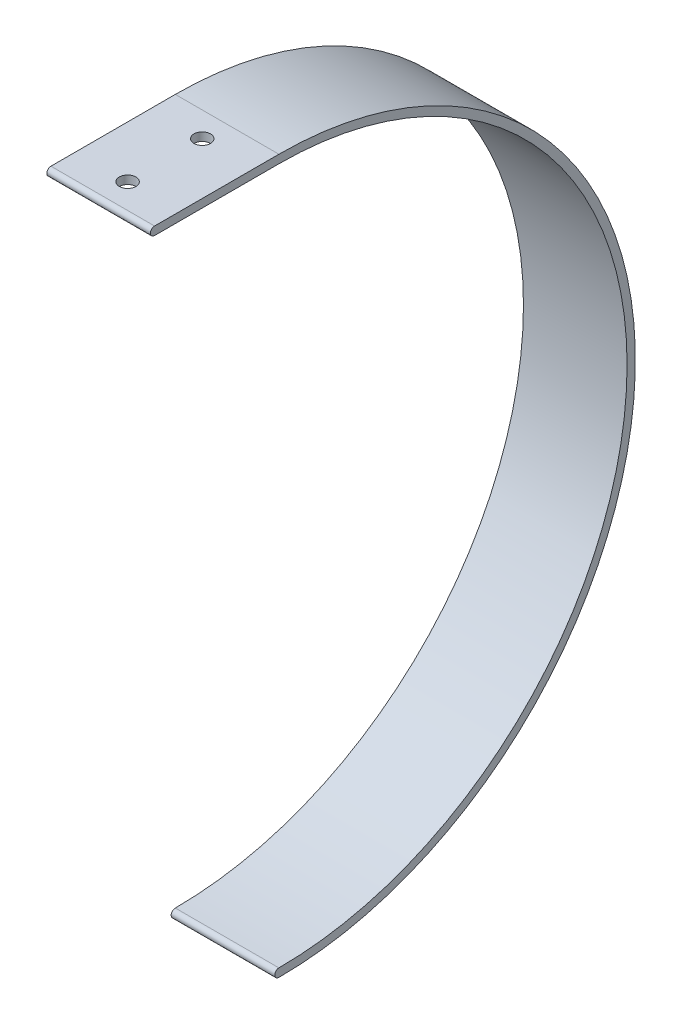
ISO-10303-21;
HEADER;
FILE_DESCRIPTION(('STEP AP214'),'2;1');
FILE_NAME('part.step','',(''),(''),'','','');
FILE_SCHEMA(('AUTOMOTIVE_DESIGN { 1 0 10303 214 1 1 1 1 }'));
ENDSEC;
DATA;
#1=APPLICATION_CONTEXT('core data for automotive mechanical design processes');
#2=APPLICATION_PROTOCOL_DEFINITION('international standard','automotive_design',2000,#1);
#3=PRODUCT_CONTEXT('',#1,'mechanical');
#4=PRODUCT('Part','Part','',(#3));
#5=PRODUCT_RELATED_PRODUCT_CATEGORY('part','',(#4));
#6=PRODUCT_DEFINITION_FORMATION('','',#4);
#7=PRODUCT_DEFINITION_CONTEXT('part definition',#1,'design');
#8=PRODUCT_DEFINITION('design','',#6,#7);
#9=PRODUCT_DEFINITION_SHAPE('','',#8);
#10=(LENGTH_UNIT() NAMED_UNIT(*) SI_UNIT(.MILLI.,.METRE.));
#11=(NAMED_UNIT(*) PLANE_ANGLE_UNIT() SI_UNIT($,.RADIAN.));
#12=(NAMED_UNIT(*) SI_UNIT($,.STERADIAN.) SOLID_ANGLE_UNIT());
#13=UNCERTAINTY_MEASURE_WITH_UNIT(LENGTH_MEASURE(1.E-05),#10,'distance_accuracy_value','');
#14=(GEOMETRIC_REPRESENTATION_CONTEXT(3) GLOBAL_UNCERTAINTY_ASSIGNED_CONTEXT((#13)) GLOBAL_UNIT_ASSIGNED_CONTEXT((#10,
#11,#12)) REPRESENTATION_CONTEXT('',''));
#15=CARTESIAN_POINT('',(0.,0.,0.));
#16=DIRECTION('',(0.,0.,1.));
#17=DIRECTION('',(1.,0.,0.));
#18=AXIS2_PLACEMENT_3D('',#15,#16,#17);
#19=CARTESIAN_POINT('',(25.,0.,-10.));
#20=DIRECTION('',(-1.,0.,0.));
#21=DIRECTION('',(0.,0.,1.));
#22=AXIS2_PLACEMENT_3D('',#19,#20,#21);
#23=CYLINDRICAL_SURFACE('',#22,84.);
#24=CARTESIAN_POINT('',(0.,0.,-10.));
#25=DIRECTION('',(-1.,0.,0.));
#26=DIRECTION('',(0.,0.,1.));
#27=AXIS2_PLACEMENT_3D('',#24,#25,#26);
#28=CIRCLE('',#27,84.);
#29=CARTESIAN_POINT('',(0.,84.,-10.));
#30=VERTEX_POINT('',#29);
#31=CARTESIAN_POINT('',(0.,-84.,-9.99999999999999));
#32=VERTEX_POINT('',#31);
#33=EDGE_CURVE('E119',#30,#32,#28,.T.);
#34=ORIENTED_EDGE('',*,*,#33,.T.);
#35=DIRECTION('',(-1.,0.,0.));
#36=VECTOR('',#35,1.);
#37=CARTESIAN_POINT('',(25.,-84.,-9.99999999999999));
#38=LINE('',#37,#36);
#39=CARTESIAN_POINT('',(25.,-84.,-9.99999999999999));
#40=VERTEX_POINT('',#39);
#41=EDGE_CURVE('E11',#40,#32,#38,.T.);
#42=ORIENTED_EDGE('',*,*,#41,.F.);
#43=CARTESIAN_POINT('',(25.,0.,-10.));
#44=DIRECTION('',(-1.,0.,0.));
#45=DIRECTION('',(0.,0.,1.));
#46=AXIS2_PLACEMENT_3D('',#43,#44,#45);
#47=CIRCLE('',#46,84.);
#48=CARTESIAN_POINT('',(25.,84.,-10.));
#49=VERTEX_POINT('',#48);
#50=EDGE_CURVE('E130',#49,#40,#47,.T.);
#51=ORIENTED_EDGE('',*,*,#50,.F.);
#52=DIRECTION('',(-1.,0.,0.));
#53=VECTOR('',#52,1.);
#54=CARTESIAN_POINT('',(25.,84.,-10.));
#55=LINE('',#54,#53);
#56=EDGE_CURVE('E115',#49,#30,#55,.T.);
#57=ORIENTED_EDGE('',*,*,#56,.T.);
#58=EDGE_LOOP('',(#34,#42,#51,#57));
#59=FACE_BOUND('',#58,.T.);
#60=ADVANCED_FACE('F33',(#59),#23,.F.);
#61=CARTESIAN_POINT('',(25.,-85.,-10.));
#62=DIRECTION('',(-1.,0.,0.));
#63=DIRECTION('',(0.,0.,1.));
#64=AXIS2_PLACEMENT_3D('',#61,#62,#63);
#65=CYLINDRICAL_SURFACE('',#64,1.);
#66=CARTESIAN_POINT('',(0.,-85.,-10.));
#67=DIRECTION('',(1.,0.,0.));
#68=DIRECTION('',(0.,0.,-1.));
#69=AXIS2_PLACEMENT_3D('',#66,#67,#68);
#70=CIRCLE('',#69,1.);
#71=CARTESIAN_POINT('',(0.,-86.,-10.));
#72=VERTEX_POINT('',#71);
#73=EDGE_CURVE('E122',#32,#72,#70,.T.);
#74=ORIENTED_EDGE('',*,*,#73,.T.);
#75=DIRECTION('',(-1.,0.,0.));
#76=VECTOR('',#75,1.);
#77=CARTESIAN_POINT('',(25.,-86.,-10.));
#78=LINE('',#77,#76);
#79=CARTESIAN_POINT('',(25.,-86.,-10.));
#80=VERTEX_POINT('',#79);
#81=EDGE_CURVE('E42',#80,#72,#78,.T.);
#82=ORIENTED_EDGE('',*,*,#81,.F.);
#83=CARTESIAN_POINT('',(25.,-85.,-10.));
#84=DIRECTION('',(1.,0.,0.));
#85=DIRECTION('',(0.,0.,-1.));
#86=AXIS2_PLACEMENT_3D('',#83,#84,#85);
#87=CIRCLE('',#86,1.);
#88=EDGE_CURVE('E88',#40,#80,#87,.T.);
#89=ORIENTED_EDGE('',*,*,#88,.F.);
#90=ORIENTED_EDGE('',*,*,#41,.T.);
#91=EDGE_LOOP('',(#74,#82,#89,#90));
#92=FACE_BOUND('',#91,.T.);
#93=ADVANCED_FACE('F150',(#92),#65,.T.);
#94=CARTESIAN_POINT('',(25.,0.,-10.));
#95=DIRECTION('',(-1.,0.,0.));
#96=DIRECTION('',(0.,0.,1.));
#97=AXIS2_PLACEMENT_3D('',#94,#95,#96);
#98=CYLINDRICAL_SURFACE('',#97,86.);
#99=CARTESIAN_POINT('',(0.,0.,-10.));
#100=DIRECTION('',(1.,0.,0.));
#101=DIRECTION('',(0.,0.,1.));
#102=AXIS2_PLACEMENT_3D('',#99,#100,#101);
#103=CIRCLE('',#102,86.);
#104=CARTESIAN_POINT('',(0.,86.,-10.));
#105=VERTEX_POINT('',#104);
#106=EDGE_CURVE('E125',#72,#105,#103,.T.);
#107=ORIENTED_EDGE('',*,*,#106,.T.);
#108=DIRECTION('',(-1.,0.,0.));
#109=VECTOR('',#108,1.);
#110=CARTESIAN_POINT('',(25.,86.,-10.));
#111=LINE('',#110,#109);
#112=CARTESIAN_POINT('',(25.,86.,-10.));
#113=VERTEX_POINT('',#112);
#114=EDGE_CURVE('E110',#113,#105,#111,.T.);
#115=ORIENTED_EDGE('',*,*,#114,.F.);
#116=CARTESIAN_POINT('',(25.,0.,-10.));
#117=DIRECTION('',(1.,0.,0.));
#118=DIRECTION('',(0.,0.,1.));
#119=AXIS2_PLACEMENT_3D('',#116,#117,#118);
#120=CIRCLE('',#119,86.);
#121=EDGE_CURVE('E101',#80,#113,#120,.T.);
#122=ORIENTED_EDGE('',*,*,#121,.F.);
#123=ORIENTED_EDGE('',*,*,#81,.T.);
#124=EDGE_LOOP('',(#107,#115,#122,#123));
#125=FACE_BOUND('',#124,.T.);
#126=ADVANCED_FACE('F153',(#125),#98,.T.);
#127=CARTESIAN_POINT('',(25.,86.,-10.));
#128=DIRECTION('',(0.,-1.,0.));
#129=DIRECTION('',(0.,0.,-1.));
#130=AXIS2_PLACEMENT_3D('',#127,#128,#129);
#131=PLANE('',#130);
#132=CARTESIAN_POINT('',(12.5,86.,14.));
#133=DIRECTION('',(0.,1.,0.));
#134=DIRECTION('',(0.,0.,1.));
#135=AXIS2_PLACEMENT_3D('',#132,#133,#134);
#136=CIRCLE('',#135,2.);
#137=CARTESIAN_POINT('',(12.5,86.,16.));
#138=VERTEX_POINT('',#137);
#139=EDGE_CURVE('E144',#138,#138,#136,.T.);
#140=ORIENTED_EDGE('',*,*,#139,.F.);
#141=EDGE_LOOP('',(#140));
#142=FACE_BOUND('',#141,.T.);
#143=CARTESIAN_POINT('',(12.5,86.,-4.));
#144=DIRECTION('',(0.,1.,0.));
#145=DIRECTION('',(0.,0.,1.));
#146=AXIS2_PLACEMENT_3D('',#143,#144,#145);
#147=CIRCLE('',#146,2.);
#148=CARTESIAN_POINT('',(12.5,86.,-2.));
#149=VERTEX_POINT('',#148);
#150=EDGE_CURVE('E136',#149,#149,#147,.T.);
#151=ORIENTED_EDGE('',*,*,#150,.F.);
#152=EDGE_LOOP('',(#151));
#153=FACE_BOUND('',#152,.T.);
#154=DIRECTION('',(0.,0.,1.));
#155=VECTOR('',#154,1.);
#156=CARTESIAN_POINT('',(0.,86.,-10.));
#157=LINE('',#156,#155);
#158=CARTESIAN_POINT('',(0.,86.,20.));
#159=VERTEX_POINT('',#158);
#160=EDGE_CURVE('E109',#105,#159,#157,.T.);
#161=ORIENTED_EDGE('',*,*,#160,.T.);
#162=DIRECTION('',(-1.,0.,0.));
#163=VECTOR('',#162,1.);
#164=CARTESIAN_POINT('',(25.,86.,20.));
#165=LINE('',#164,#163);
#166=CARTESIAN_POINT('',(25.,86.,20.));
#167=VERTEX_POINT('',#166);
#168=EDGE_CURVE('E106',#167,#159,#165,.T.);
#169=ORIENTED_EDGE('',*,*,#168,.F.);
#170=DIRECTION('',(0.,0.,1.));
#171=VECTOR('',#170,1.);
#172=CARTESIAN_POINT('',(25.,86.,-10.));
#173=LINE('',#172,#171);
#174=EDGE_CURVE('E95',#113,#167,#173,.T.);
#175=ORIENTED_EDGE('',*,*,#174,.F.);
#176=ORIENTED_EDGE('',*,*,#114,.T.);
#177=EDGE_LOOP('',(#161,#169,#175,#176));
#178=FACE_BOUND('',#177,.T.);
#179=ADVANCED_FACE('F107',(#142,#153,#178),#131,.F.);
#180=CARTESIAN_POINT('',(25.,85.,20.));
#181=DIRECTION('',(-1.,0.,0.));
#182=DIRECTION('',(0.,0.,1.));
#183=AXIS2_PLACEMENT_3D('',#180,#181,#182);
#184=CYLINDRICAL_SURFACE('',#183,1.);
#185=CARTESIAN_POINT('',(0.,85.,20.));
#186=DIRECTION('',(1.,0.,0.));
#187=DIRECTION('',(0.,0.,1.));
#188=AXIS2_PLACEMENT_3D('',#185,#186,#187);
#189=CIRCLE('',#188,1.);
#190=CARTESIAN_POINT('',(0.,84.,20.));
#191=VERTEX_POINT('',#190);
#192=EDGE_CURVE('E74',#159,#191,#189,.T.);
#193=ORIENTED_EDGE('',*,*,#192,.T.);
#194=DIRECTION('',(-1.,0.,0.));
#195=VECTOR('',#194,1.);
#196=CARTESIAN_POINT('',(25.,84.,20.));
#197=LINE('',#196,#195);
#198=CARTESIAN_POINT('',(25.,84.,20.));
#199=VERTEX_POINT('',#198);
#200=EDGE_CURVE('E111',#199,#191,#197,.T.);
#201=ORIENTED_EDGE('',*,*,#200,.F.);
#202=CARTESIAN_POINT('',(25.,85.,20.));
#203=DIRECTION('',(1.,0.,0.));
#204=DIRECTION('',(0.,0.,1.));
#205=AXIS2_PLACEMENT_3D('',#202,#203,#204);
#206=CIRCLE('',#205,1.);
#207=EDGE_CURVE('E99',#167,#199,#206,.T.);
#208=ORIENTED_EDGE('',*,*,#207,.F.);
#209=ORIENTED_EDGE('',*,*,#168,.T.);
#210=EDGE_LOOP('',(#193,#201,#208,#209));
#211=FACE_BOUND('',#210,.T.);
#212=ADVANCED_FACE('F113',(#211),#184,.T.);
#213=CARTESIAN_POINT('',(25.,84.,-10.));
#214=DIRECTION('',(0.,1.,0.));
#215=DIRECTION('',(0.,0.,1.));
#216=AXIS2_PLACEMENT_3D('',#213,#214,#215);
#217=PLANE('',#216);
#218=CARTESIAN_POINT('',(12.5,84.,14.));
#219=DIRECTION('',(0.,1.,0.));
#220=DIRECTION('',(0.,0.,1.));
#221=AXIS2_PLACEMENT_3D('',#218,#219,#220);
#222=CIRCLE('',#221,2.);
#223=CARTESIAN_POINT('',(12.5,84.,16.));
#224=VERTEX_POINT('',#223);
#225=EDGE_CURVE('E36',#224,#224,#222,.T.);
#226=ORIENTED_EDGE('',*,*,#225,.T.);
#227=EDGE_LOOP('',(#226));
#228=FACE_BOUND('',#227,.T.);
#229=CARTESIAN_POINT('',(12.5,84.,-4.));
#230=DIRECTION('',(0.,1.,0.));
#231=DIRECTION('',(0.,0.,1.));
#232=AXIS2_PLACEMENT_3D('',#229,#230,#231);
#233=CIRCLE('',#232,2.);
#234=CARTESIAN_POINT('',(12.5,84.,-2.));
#235=VERTEX_POINT('',#234);
#236=EDGE_CURVE('E123',#235,#235,#233,.T.);
#237=ORIENTED_EDGE('',*,*,#236,.T.);
#238=EDGE_LOOP('',(#237));
#239=FACE_BOUND('',#238,.T.);
#240=DIRECTION('',(0.,0.,-1.));
#241=VECTOR('',#240,1.);
#242=CARTESIAN_POINT('',(0.,84.,-10.));
#243=LINE('',#242,#241);
#244=EDGE_CURVE('E80',#191,#30,#243,.T.);
#245=ORIENTED_EDGE('',*,*,#244,.T.);
#246=ORIENTED_EDGE('',*,*,#56,.F.);
#247=DIRECTION('',(0.,0.,-1.));
#248=VECTOR('',#247,1.);
#249=CARTESIAN_POINT('',(25.,84.,-10.));
#250=LINE('',#249,#248);
#251=EDGE_CURVE('E51',#199,#49,#250,.T.);
#252=ORIENTED_EDGE('',*,*,#251,.F.);
#253=ORIENTED_EDGE('',*,*,#200,.T.);
#254=EDGE_LOOP('',(#245,#246,#252,#253));
#255=FACE_BOUND('',#254,.T.);
#256=ADVANCED_FACE('F158',(#228,#239,#255),#217,.F.);
#257=CARTESIAN_POINT('',(25.,0.,-10.));
#258=DIRECTION('',(-1.,0.,0.));
#259=DIRECTION('',(0.,0.,1.));
#260=AXIS2_PLACEMENT_3D('',#257,#258,#259);
#261=PLANE('',#260);
#262=ORIENTED_EDGE('',*,*,#50,.T.);
#263=ORIENTED_EDGE('',*,*,#88,.T.);
#264=ORIENTED_EDGE('',*,*,#121,.T.);
#265=ORIENTED_EDGE('',*,*,#174,.T.);
#266=ORIENTED_EDGE('',*,*,#207,.T.);
#267=ORIENTED_EDGE('',*,*,#251,.T.);
#268=EDGE_LOOP('',(#262,#263,#264,#265,#266,#267));
#269=FACE_BOUND('',#268,.T.);
#270=ADVANCED_FACE('F97',(#269),#261,.F.);
#271=CARTESIAN_POINT('',(0.,0.,-10.));
#272=DIRECTION('',(-1.,0.,0.));
#273=DIRECTION('',(0.,0.,1.));
#274=AXIS2_PLACEMENT_3D('',#271,#272,#273);
#275=PLANE('',#274);
#276=ORIENTED_EDGE('',*,*,#33,.F.);
#277=ORIENTED_EDGE('',*,*,#244,.F.);
#278=ORIENTED_EDGE('',*,*,#192,.F.);
#279=ORIENTED_EDGE('',*,*,#160,.F.);
#280=ORIENTED_EDGE('',*,*,#106,.F.);
#281=ORIENTED_EDGE('',*,*,#73,.F.);
#282=EDGE_LOOP('',(#276,#277,#278,#279,#280,#281));
#283=FACE_BOUND('',#282,.T.);
#284=ADVANCED_FACE('F156',(#283),#275,.T.);
#285=CARTESIAN_POINT('',(12.5,86.,-4.));
#286=DIRECTION('',(0.,1.,0.));
#287=DIRECTION('',(0.,0.,1.));
#288=AXIS2_PLACEMENT_3D('',#285,#286,#287);
#289=CYLINDRICAL_SURFACE('',#288,2.);
#290=ORIENTED_EDGE('',*,*,#150,.T.);
#291=EDGE_LOOP('',(#290));
#292=FACE_BOUND('',#291,.T.);
#293=ORIENTED_EDGE('',*,*,#236,.F.);
#294=EDGE_LOOP('',(#293));
#295=FACE_BOUND('',#294,.T.);
#296=ADVANCED_FACE('F189',(#292,#295),#289,.F.);
#297=CARTESIAN_POINT('',(12.5,86.,14.));
#298=DIRECTION('',(0.,1.,0.));
#299=DIRECTION('',(0.,0.,1.));
#300=AXIS2_PLACEMENT_3D('',#297,#298,#299);
#301=CYLINDRICAL_SURFACE('',#300,2.);
#302=ORIENTED_EDGE('',*,*,#139,.T.);
#303=EDGE_LOOP('',(#302));
#304=FACE_BOUND('',#303,.T.);
#305=ORIENTED_EDGE('',*,*,#225,.F.);
#306=EDGE_LOOP('',(#305));
#307=FACE_BOUND('',#306,.T.);
#308=ADVANCED_FACE('F186',(#304,#307),#301,.F.);
#309=CLOSED_SHELL('',(#60,#93,#126,#179,#212,#256,#270,#284,#296,#308));
#310=MANIFOLD_SOLID_BREP('B2',#309);
#311=ADVANCED_BREP_SHAPE_REPRESENTATION('',(#18,#310),#14);
#312=SHAPE_DEFINITION_REPRESENTATION(#9,#311);
ENDSEC;
END-ISO-10303-21;
